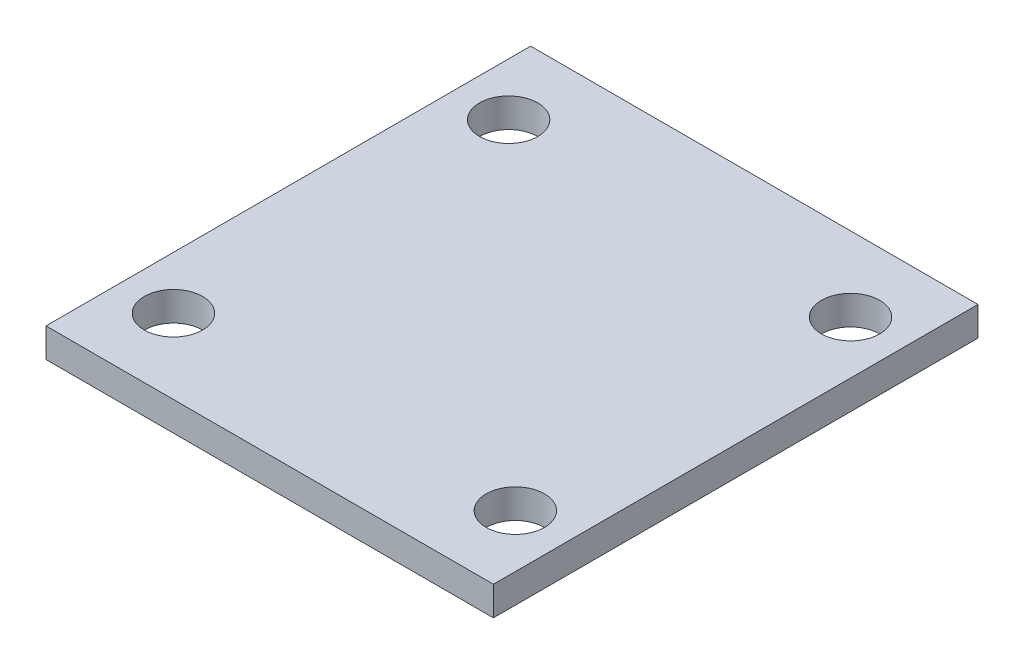
ISO-10303-21;
HEADER;
FILE_DESCRIPTION(('STEP AP214'),'2;1');
FILE_NAME('part.step','',(''),(''),'','','');
FILE_SCHEMA(('AUTOMOTIVE_DESIGN { 1 0 10303 214 1 1 1 1 }'));
ENDSEC;
DATA;
#1=APPLICATION_CONTEXT('core data for automotive mechanical design processes');
#2=APPLICATION_PROTOCOL_DEFINITION('international standard','automotive_design',2000,#1);
#3=PRODUCT_CONTEXT('',#1,'mechanical');
#4=PRODUCT('Part','Part','',(#3));
#5=PRODUCT_RELATED_PRODUCT_CATEGORY('part','',(#4));
#6=PRODUCT_DEFINITION_FORMATION('','',#4);
#7=PRODUCT_DEFINITION_CONTEXT('part definition',#1,'design');
#8=PRODUCT_DEFINITION('design','',#6,#7);
#9=PRODUCT_DEFINITION_SHAPE('','',#8);
#10=(LENGTH_UNIT() NAMED_UNIT(*) SI_UNIT(.MILLI.,.METRE.));
#11=(NAMED_UNIT(*) PLANE_ANGLE_UNIT() SI_UNIT($,.RADIAN.));
#12=(NAMED_UNIT(*) SI_UNIT($,.STERADIAN.) SOLID_ANGLE_UNIT());
#13=UNCERTAINTY_MEASURE_WITH_UNIT(LENGTH_MEASURE(1.E-05),#10,'distance_accuracy_value','');
#14=(GEOMETRIC_REPRESENTATION_CONTEXT(3) GLOBAL_UNCERTAINTY_ASSIGNED_CONTEXT((#13)) GLOBAL_UNIT_ASSIGNED_CONTEXT((#10,
#11,#12)) REPRESENTATION_CONTEXT('',''));
#15=CARTESIAN_POINT('',(0.,0.,0.));
#16=DIRECTION('',(0.,0.,1.));
#17=DIRECTION('',(1.,0.,0.));
#18=AXIS2_PLACEMENT_3D('',#15,#16,#17);
#19=CARTESIAN_POINT('',(0.,2.,0.));
#20=DIRECTION('',(0.,-1.,0.));
#21=DIRECTION('',(0.,0.,-1.));
#22=AXIS2_PLACEMENT_3D('',#19,#20,#21);
#23=PLANE('',#22);
#24=DIRECTION('',(1.,0.,0.));
#25=VECTOR('',#24,1.);
#26=CARTESIAN_POINT('',(30.7,2.,0.));
#27=LINE('',#26,#25);
#28=CARTESIAN_POINT('',(0.,2.,0.));
#29=VERTEX_POINT('',#28);
#30=CARTESIAN_POINT('',(30.7,2.,0.));
#31=VERTEX_POINT('',#30);
#32=EDGE_CURVE('E89',#29,#31,#27,.T.);
#33=ORIENTED_EDGE('',*,*,#32,.T.);
#34=DIRECTION('',(0.,0.,-1.));
#35=VECTOR('',#34,1.);
#36=CARTESIAN_POINT('',(30.7,2.,-33.25));
#37=LINE('',#36,#35);
#38=CARTESIAN_POINT('',(30.7,2.,-33.25));
#39=VERTEX_POINT('',#38);
#40=EDGE_CURVE('E84',#31,#39,#37,.T.);
#41=ORIENTED_EDGE('',*,*,#40,.T.);
#42=DIRECTION('',(-1.,0.,0.));
#43=VECTOR('',#42,1.);
#44=CARTESIAN_POINT('',(0.,2.,-33.25));
#45=LINE('',#44,#43);
#46=CARTESIAN_POINT('',(0.,2.,-33.25));
#47=VERTEX_POINT('',#46);
#48=EDGE_CURVE('E87',#39,#47,#45,.T.);
#49=ORIENTED_EDGE('',*,*,#48,.T.);
#50=DIRECTION('',(0.,0.,1.));
#51=VECTOR('',#50,1.);
#52=CARTESIAN_POINT('',(0.,2.,0.));
#53=LINE('',#52,#51);
#54=EDGE_CURVE('E54',#47,#29,#53,.T.);
#55=ORIENTED_EDGE('',*,*,#54,.T.);
#56=EDGE_LOOP('',(#33,#41,#49,#55));
#57=FACE_BOUND('',#56,.T.);
#58=CARTESIAN_POINT('',(3.62,2.,-28.125));
#59=DIRECTION('',(0.,1.,0.));
#60=DIRECTION('',(0.,0.,1.));
#61=AXIS2_PLACEMENT_3D('',#58,#59,#60);
#62=CIRCLE('',#61,2.);
#63=CARTESIAN_POINT('',(3.62,2.,-26.125));
#64=VERTEX_POINT('',#63);
#65=EDGE_CURVE('E104',#64,#64,#62,.T.);
#66=ORIENTED_EDGE('',*,*,#65,.F.);
#67=EDGE_LOOP('',(#66));
#68=FACE_BOUND('',#67,.T.);
#69=CARTESIAN_POINT('',(27.08,2.,-28.125));
#70=DIRECTION('',(0.,1.,0.));
#71=DIRECTION('',(0.,0.,1.));
#72=AXIS2_PLACEMENT_3D('',#69,#70,#71);
#73=CIRCLE('',#72,2.);
#74=CARTESIAN_POINT('',(27.08,2.,-26.125));
#75=VERTEX_POINT('',#74);
#76=EDGE_CURVE('E119',#75,#75,#73,.T.);
#77=ORIENTED_EDGE('',*,*,#76,.F.);
#78=EDGE_LOOP('',(#77));
#79=FACE_BOUND('',#78,.T.);
#80=CARTESIAN_POINT('',(27.08,2.,-5.125));
#81=DIRECTION('',(0.,1.,0.));
#82=DIRECTION('',(0.,0.,1.));
#83=AXIS2_PLACEMENT_3D('',#80,#81,#82);
#84=CIRCLE('',#83,2.);
#85=CARTESIAN_POINT('',(27.08,2.,-3.125));
#86=VERTEX_POINT('',#85);
#87=EDGE_CURVE('E125',#86,#86,#84,.T.);
#88=ORIENTED_EDGE('',*,*,#87,.F.);
#89=EDGE_LOOP('',(#88));
#90=FACE_BOUND('',#89,.T.);
#91=CARTESIAN_POINT('',(3.62,2.,-5.125));
#92=DIRECTION('',(0.,1.,0.));
#93=DIRECTION('',(0.,0.,1.));
#94=AXIS2_PLACEMENT_3D('',#91,#92,#93);
#95=CIRCLE('',#94,2.);
#96=CARTESIAN_POINT('',(3.62,2.,-3.125));
#97=VERTEX_POINT('',#96);
#98=EDGE_CURVE('E131',#97,#97,#95,.T.);
#99=ORIENTED_EDGE('',*,*,#98,.F.);
#100=EDGE_LOOP('',(#99));
#101=FACE_BOUND('',#100,.T.);
#102=ADVANCED_FACE('F37',(#57,#68,#79,#90,#101),#23,.F.);
#103=CARTESIAN_POINT('',(0.,0.,0.));
#104=DIRECTION('',(0.,-1.,0.));
#105=DIRECTION('',(0.,0.,-1.));
#106=AXIS2_PLACEMENT_3D('',#103,#104,#105);
#107=PLANE('',#106);
#108=CARTESIAN_POINT('',(27.08,0.,-5.125));
#109=DIRECTION('',(0.,1.,0.));
#110=DIRECTION('',(0.,0.,1.));
#111=AXIS2_PLACEMENT_3D('',#108,#109,#110);
#112=CIRCLE('',#111,2.);
#113=CARTESIAN_POINT('',(27.08,0.,-3.125));
#114=VERTEX_POINT('',#113);
#115=EDGE_CURVE('E128',#114,#114,#112,.T.);
#116=ORIENTED_EDGE('',*,*,#115,.T.);
#117=EDGE_LOOP('',(#116));
#118=FACE_BOUND('',#117,.T.);
#119=CARTESIAN_POINT('',(3.62,0.,-28.125));
#120=DIRECTION('',(0.,1.,0.));
#121=DIRECTION('',(0.,0.,1.));
#122=AXIS2_PLACEMENT_3D('',#119,#120,#121);
#123=CIRCLE('',#122,2.);
#124=CARTESIAN_POINT('',(3.62,0.,-26.125));
#125=VERTEX_POINT('',#124);
#126=EDGE_CURVE('E116',#125,#125,#123,.T.);
#127=ORIENTED_EDGE('',*,*,#126,.T.);
#128=EDGE_LOOP('',(#127));
#129=FACE_BOUND('',#128,.T.);
#130=DIRECTION('',(1.,0.,0.));
#131=VECTOR('',#130,1.);
#132=CARTESIAN_POINT('',(30.7,0.,0.));
#133=LINE('',#132,#131);
#134=CARTESIAN_POINT('',(0.,0.,0.));
#135=VERTEX_POINT('',#134);
#136=CARTESIAN_POINT('',(30.7,0.,0.));
#137=VERTEX_POINT('',#136);
#138=EDGE_CURVE('E101',#135,#137,#133,.T.);
#139=ORIENTED_EDGE('',*,*,#138,.F.);
#140=DIRECTION('',(0.,0.,1.));
#141=VECTOR('',#140,1.);
#142=CARTESIAN_POINT('',(0.,0.,0.));
#143=LINE('',#142,#141);
#144=CARTESIAN_POINT('',(0.,0.,-33.25));
#145=VERTEX_POINT('',#144);
#146=EDGE_CURVE('E77',#145,#135,#143,.T.);
#147=ORIENTED_EDGE('',*,*,#146,.F.);
#148=DIRECTION('',(-1.,0.,0.));
#149=VECTOR('',#148,1.);
#150=CARTESIAN_POINT('',(0.,0.,-33.25));
#151=LINE('',#150,#149);
#152=CARTESIAN_POINT('',(30.7,0.,-33.25));
#153=VERTEX_POINT('',#152);
#154=EDGE_CURVE('E71',#153,#145,#151,.T.);
#155=ORIENTED_EDGE('',*,*,#154,.F.);
#156=DIRECTION('',(0.,0.,-1.));
#157=VECTOR('',#156,1.);
#158=CARTESIAN_POINT('',(30.7,0.,-33.25));
#159=LINE('',#158,#157);
#160=EDGE_CURVE('E93',#137,#153,#159,.T.);
#161=ORIENTED_EDGE('',*,*,#160,.F.);
#162=EDGE_LOOP('',(#139,#147,#155,#161));
#163=FACE_BOUND('',#162,.T.);
#164=CARTESIAN_POINT('',(27.08,0.,-28.125));
#165=DIRECTION('',(0.,1.,0.));
#166=DIRECTION('',(0.,0.,1.));
#167=AXIS2_PLACEMENT_3D('',#164,#165,#166);
#168=CIRCLE('',#167,2.);
#169=CARTESIAN_POINT('',(27.08,0.,-26.125));
#170=VERTEX_POINT('',#169);
#171=EDGE_CURVE('E122',#170,#170,#168,.T.);
#172=ORIENTED_EDGE('',*,*,#171,.T.);
#173=EDGE_LOOP('',(#172));
#174=FACE_BOUND('',#173,.T.);
#175=CARTESIAN_POINT('',(3.62,0.,-5.125));
#176=DIRECTION('',(0.,1.,0.));
#177=DIRECTION('',(0.,0.,1.));
#178=AXIS2_PLACEMENT_3D('',#175,#176,#177);
#179=CIRCLE('',#178,2.);
#180=CARTESIAN_POINT('',(3.62,0.,-3.125));
#181=VERTEX_POINT('',#180);
#182=EDGE_CURVE('E134',#181,#181,#179,.T.);
#183=ORIENTED_EDGE('',*,*,#182,.T.);
#184=EDGE_LOOP('',(#183));
#185=FACE_BOUND('',#184,.T.);
#186=ADVANCED_FACE('F112',(#118,#129,#163,#174,#185),#107,.T.);
#187=CARTESIAN_POINT('',(30.7,2.,0.));
#188=DIRECTION('',(0.,0.,-1.));
#189=DIRECTION('',(-1.,0.,0.));
#190=AXIS2_PLACEMENT_3D('',#187,#188,#189);
#191=PLANE('',#190);
#192=ORIENTED_EDGE('',*,*,#138,.T.);
#193=DIRECTION('',(0.,-1.,0.));
#194=VECTOR('',#193,1.);
#195=CARTESIAN_POINT('',(30.7,2.,0.));
#196=LINE('',#195,#194);
#197=EDGE_CURVE('E11',#31,#137,#196,.T.);
#198=ORIENTED_EDGE('',*,*,#197,.F.);
#199=ORIENTED_EDGE('',*,*,#32,.F.);
#200=DIRECTION('',(0.,-1.,0.));
#201=VECTOR('',#200,1.);
#202=CARTESIAN_POINT('',(0.,2.,0.));
#203=LINE('',#202,#201);
#204=EDGE_CURVE('E97',#29,#135,#203,.T.);
#205=ORIENTED_EDGE('',*,*,#204,.T.);
#206=EDGE_LOOP('',(#192,#198,#199,#205));
#207=FACE_BOUND('',#206,.T.);
#208=ADVANCED_FACE('F39',(#207),#191,.F.);
#209=CARTESIAN_POINT('',(30.7,2.,-33.25));
#210=DIRECTION('',(-1.,0.,0.));
#211=DIRECTION('',(0.,0.,1.));
#212=AXIS2_PLACEMENT_3D('',#209,#210,#211);
#213=PLANE('',#212);
#214=ORIENTED_EDGE('',*,*,#160,.T.);
#215=DIRECTION('',(0.,-1.,0.));
#216=VECTOR('',#215,1.);
#217=CARTESIAN_POINT('',(30.7,2.,-33.25));
#218=LINE('',#217,#216);
#219=EDGE_CURVE('E46',#39,#153,#218,.T.);
#220=ORIENTED_EDGE('',*,*,#219,.F.);
#221=ORIENTED_EDGE('',*,*,#40,.F.);
#222=ORIENTED_EDGE('',*,*,#197,.T.);
#223=EDGE_LOOP('',(#214,#220,#221,#222));
#224=FACE_BOUND('',#223,.T.);
#225=ADVANCED_FACE('F92',(#224),#213,.F.);
#226=CARTESIAN_POINT('',(0.,2.,-33.25));
#227=DIRECTION('',(0.,0.,1.));
#228=DIRECTION('',(1.,0.,0.));
#229=AXIS2_PLACEMENT_3D('',#226,#227,#228);
#230=PLANE('',#229);
#231=ORIENTED_EDGE('',*,*,#154,.T.);
#232=DIRECTION('',(0.,-1.,0.));
#233=VECTOR('',#232,1.);
#234=CARTESIAN_POINT('',(0.,2.,-33.25));
#235=LINE('',#234,#233);
#236=EDGE_CURVE('E94',#47,#145,#235,.T.);
#237=ORIENTED_EDGE('',*,*,#236,.F.);
#238=ORIENTED_EDGE('',*,*,#48,.F.);
#239=ORIENTED_EDGE('',*,*,#219,.T.);
#240=EDGE_LOOP('',(#231,#237,#238,#239));
#241=FACE_BOUND('',#240,.T.);
#242=ADVANCED_FACE('F95',(#241),#230,.F.);
#243=CARTESIAN_POINT('',(0.,2.,0.));
#244=DIRECTION('',(1.,0.,0.));
#245=DIRECTION('',(0.,0.,-1.));
#246=AXIS2_PLACEMENT_3D('',#243,#244,#245);
#247=PLANE('',#246);
#248=ORIENTED_EDGE('',*,*,#146,.T.);
#249=ORIENTED_EDGE('',*,*,#204,.F.);
#250=ORIENTED_EDGE('',*,*,#54,.F.);
#251=ORIENTED_EDGE('',*,*,#236,.T.);
#252=EDGE_LOOP('',(#248,#249,#250,#251));
#253=FACE_BOUND('',#252,.T.);
#254=ADVANCED_FACE('F109',(#253),#247,.F.);
#255=CARTESIAN_POINT('',(3.62,2.,-28.125));
#256=DIRECTION('',(0.,-1.,0.));
#257=DIRECTION('',(0.,0.,-1.));
#258=AXIS2_PLACEMENT_3D('',#255,#256,#257);
#259=CYLINDRICAL_SURFACE('',#258,2.);
#260=ORIENTED_EDGE('',*,*,#65,.T.);
#261=EDGE_LOOP('',(#260));
#262=FACE_BOUND('',#261,.T.);
#263=ORIENTED_EDGE('',*,*,#126,.F.);
#264=EDGE_LOOP('',(#263));
#265=FACE_BOUND('',#264,.T.);
#266=ADVANCED_FACE('F151',(#262,#265),#259,.F.);
#267=CARTESIAN_POINT('',(27.08,2.,-28.125));
#268=DIRECTION('',(0.,-1.,0.));
#269=DIRECTION('',(0.,0.,-1.));
#270=AXIS2_PLACEMENT_3D('',#267,#268,#269);
#271=CYLINDRICAL_SURFACE('',#270,2.);
#272=ORIENTED_EDGE('',*,*,#76,.T.);
#273=EDGE_LOOP('',(#272));
#274=FACE_BOUND('',#273,.T.);
#275=ORIENTED_EDGE('',*,*,#171,.F.);
#276=EDGE_LOOP('',(#275));
#277=FACE_BOUND('',#276,.T.);
#278=ADVANCED_FACE('F197',(#274,#277),#271,.F.);
#279=CARTESIAN_POINT('',(27.08,2.,-5.125));
#280=DIRECTION('',(0.,-1.,0.));
#281=DIRECTION('',(0.,0.,-1.));
#282=AXIS2_PLACEMENT_3D('',#279,#280,#281);
#283=CYLINDRICAL_SURFACE('',#282,2.);
#284=ORIENTED_EDGE('',*,*,#87,.T.);
#285=EDGE_LOOP('',(#284));
#286=FACE_BOUND('',#285,.T.);
#287=ORIENTED_EDGE('',*,*,#115,.F.);
#288=EDGE_LOOP('',(#287));
#289=FACE_BOUND('',#288,.T.);
#290=ADVANCED_FACE('F205',(#286,#289),#283,.F.);
#291=CARTESIAN_POINT('',(3.62,2.,-5.125));
#292=DIRECTION('',(0.,-1.,0.));
#293=DIRECTION('',(0.,0.,-1.));
#294=AXIS2_PLACEMENT_3D('',#291,#292,#293);
#295=CYLINDRICAL_SURFACE('',#294,2.);
#296=ORIENTED_EDGE('',*,*,#98,.T.);
#297=EDGE_LOOP('',(#296));
#298=FACE_BOUND('',#297,.T.);
#299=ORIENTED_EDGE('',*,*,#182,.F.);
#300=EDGE_LOOP('',(#299));
#301=FACE_BOUND('',#300,.T.);
#302=ADVANCED_FACE('F140',(#298,#301),#295,.F.);
#303=CLOSED_SHELL('',(#102,#186,#208,#225,#242,#254,#266,#278,#290,#302));
#304=MANIFOLD_SOLID_BREP('B2',#303);
#305=ADVANCED_BREP_SHAPE_REPRESENTATION('',(#18,#304),#14);
#306=SHAPE_DEFINITION_REPRESENTATION(#9,#305);
ENDSEC;
END-ISO-10303-21;
